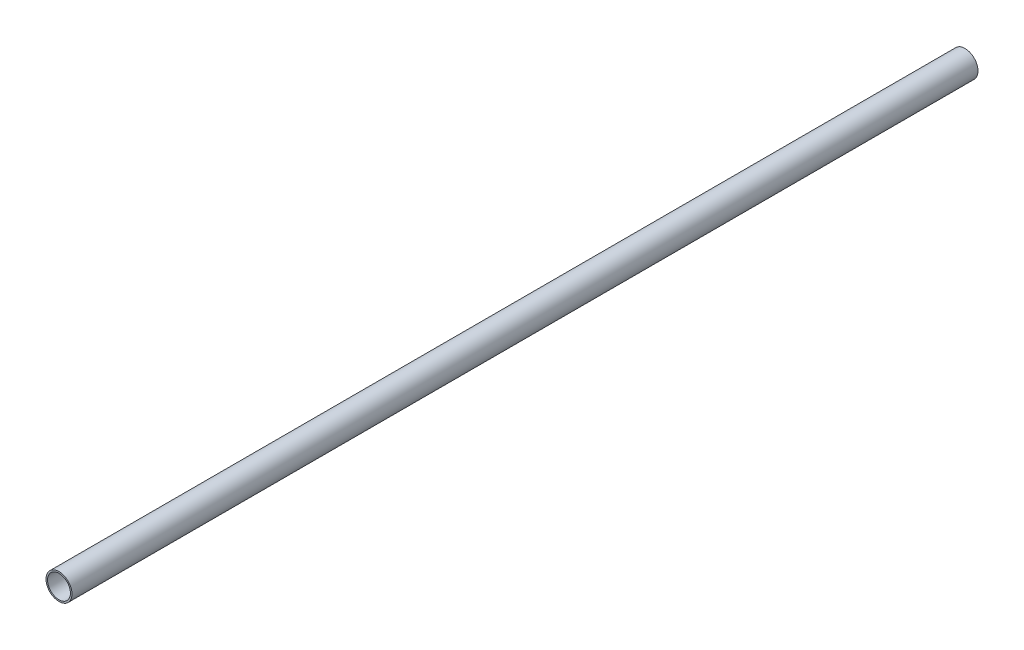
ISO-10303-21;
HEADER;
FILE_DESCRIPTION(('STEP AP214'),'2;1');
FILE_NAME('part.step','',(''),(''),'','','');
FILE_SCHEMA(('AUTOMOTIVE_DESIGN { 1 0 10303 214 1 1 1 1 }'));
ENDSEC;
DATA;
#1=APPLICATION_CONTEXT('core data for automotive mechanical design processes');
#2=APPLICATION_PROTOCOL_DEFINITION('international standard','automotive_design',2000,#1);
#3=PRODUCT_CONTEXT('',#1,'mechanical');
#4=PRODUCT('Part','Part','',(#3));
#5=PRODUCT_RELATED_PRODUCT_CATEGORY('part','',(#4));
#6=PRODUCT_DEFINITION_FORMATION('','',#4);
#7=PRODUCT_DEFINITION_CONTEXT('part definition',#1,'design');
#8=PRODUCT_DEFINITION('design','',#6,#7);
#9=PRODUCT_DEFINITION_SHAPE('','',#8);
#10=(LENGTH_UNIT() NAMED_UNIT(*) SI_UNIT(.MILLI.,.METRE.));
#11=(NAMED_UNIT(*) PLANE_ANGLE_UNIT() SI_UNIT($,.RADIAN.));
#12=(NAMED_UNIT(*) SI_UNIT($,.STERADIAN.) SOLID_ANGLE_UNIT());
#13=UNCERTAINTY_MEASURE_WITH_UNIT(LENGTH_MEASURE(1.E-05),#10,'distance_accuracy_value','');
#14=(GEOMETRIC_REPRESENTATION_CONTEXT(3) GLOBAL_UNCERTAINTY_ASSIGNED_CONTEXT((#13)) GLOBAL_UNIT_ASSIGNED_CONTEXT((#10,
#11,#12)) REPRESENTATION_CONTEXT('',''));
#15=CARTESIAN_POINT('',(0.,0.,0.));
#16=DIRECTION('',(0.,0.,1.));
#17=DIRECTION('',(1.,0.,0.));
#18=AXIS2_PLACEMENT_3D('',#15,#16,#17);
#19=CARTESIAN_POINT('',(0.,1269.,1.77635683940025E-12));
#20=DIRECTION('',(0.,0.,-0.999999999999983));
#21=DIRECTION('',(0.,1.,0.));
#22=AXIS2_PLACEMENT_3D('',#19,#20,#21);
#23=CYLINDRICAL_SURFACE('',#22,12.5);
#24=CARTESIAN_POINT('',(0.,1269.,-891.499999999976));
#25=DIRECTION('',(0.,0.,-0.999999999999983));
#26=DIRECTION('',(0.,1.,0.));
#27=AXIS2_PLACEMENT_3D('',#24,#25,#26);
#28=CIRCLE('',#27,12.5);
#29=CARTESIAN_POINT('',(2.37543317861737E-12,1281.5,-891.499999999976));
#30=VERTEX_POINT('',#29);
#31=EDGE_CURVE('E54',#30,#30,#28,.T.);
#32=CARTESIAN_POINT('',(0.,1269.,-19.9999999999982));
#33=DIRECTION('',(0.,0.,0.999999999999983));
#34=DIRECTION('',(1.,0.,0.));
#35=AXIS2_PLACEMENT_3D('',#32,#33,#34);
#36=CIRCLE('',#35,12.5);
#37=CARTESIAN_POINT('',(0.,1281.5,-19.9999999999982));
#38=VERTEX_POINT('',#37);
#39=EDGE_CURVE('E41',#38,#38,#36,.T.);
#40=CARTESIAN_POINT('',(2.37543317861737E-12,1281.5,-891.499999999976));
#41=CARTESIAN_POINT('',(2.35124419451795E-12,1281.5,-882.421874999976));
#42=CARTESIAN_POINT('',(2.32705521041853E-12,1281.5,-873.343749999977));
#43=CARTESIAN_POINT('',(2.27867724221968E-12,1281.5,-855.187499999977));
#44=CARTESIAN_POINT('',(2.25448825812026E-12,1281.5,-846.109374999977));
#45=CARTESIAN_POINT('',(2.20611028992141E-12,1281.5,-827.953124999978));
#46=CARTESIAN_POINT('',(2.18192130582199E-12,1281.5,-818.874999999978));
#47=CARTESIAN_POINT('',(2.13354333762314E-12,1281.5,-800.718749999979));
#48=CARTESIAN_POINT('',(2.10935435352372E-12,1281.5,-791.640624999979));
#49=CARTESIAN_POINT('',(2.06097638532487E-12,1281.5,-773.484374999979));
#50=CARTESIAN_POINT('',(2.03678740122545E-12,1281.5,-764.406249999979));
#51=CARTESIAN_POINT('',(1.9884094330266E-12,1281.5,-746.24999999998));
#52=CARTESIAN_POINT('',(1.96422044892718E-12,1281.5,-737.17187499998));
#53=CARTESIAN_POINT('',(1.91584248072833E-12,1281.5,-719.015624999981));
#54=CARTESIAN_POINT('',(1.89165349662891E-12,1281.5,-709.937499999981));
#55=CARTESIAN_POINT('',(1.84327552843006E-12,1281.5,-691.781249999981));
#56=CARTESIAN_POINT('',(1.81908654433064E-12,1281.5,-682.703124999982));
#57=CARTESIAN_POINT('',(1.77070857613179E-12,1281.5,-664.546874999982));
#58=CARTESIAN_POINT('',(1.74651959203237E-12,1281.5,-655.468749999982));
#59=CARTESIAN_POINT('',(1.69814162383352E-12,1281.5,-637.312499999983));
#60=CARTESIAN_POINT('',(1.6739526397341E-12,1281.5,-628.234374999983));
#61=CARTESIAN_POINT('',(1.62557467153525E-12,1281.5,-610.078124999983));
#62=CARTESIAN_POINT('',(1.60138568743583E-12,1281.5,-600.999999999984));
#63=CARTESIAN_POINT('',(1.55300771923698E-12,1281.5,-582.843749999984));
#64=CARTESIAN_POINT('',(1.52881873513756E-12,1281.5,-573.765624999984));
#65=CARTESIAN_POINT('',(1.48044076693871E-12,1281.5,-555.609374999985));
#66=CARTESIAN_POINT('',(1.45625178283929E-12,1281.5,-546.531249999985));
#67=CARTESIAN_POINT('',(1.40787381464044E-12,1281.5,-528.374999999985));
#68=CARTESIAN_POINT('',(1.38368483054102E-12,1281.5,-519.296874999986));
#69=CARTESIAN_POINT('',(1.33530686234217E-12,1281.5,-501.140624999986));
#70=CARTESIAN_POINT('',(1.31111787824275E-12,1281.5,-492.062499999986));
#71=CARTESIAN_POINT('',(1.2627399100439E-12,1281.5,-473.906249999987));
#72=CARTESIAN_POINT('',(1.23855092594448E-12,1281.5,-464.828124999987));
#73=CARTESIAN_POINT('',(1.19017295774563E-12,1281.5,-446.671874999987));
#74=CARTESIAN_POINT('',(1.16598397364621E-12,1281.5,-437.593749999988));
#75=CARTESIAN_POINT('',(1.11760600544736E-12,1281.5,-419.437499999988));
#76=CARTESIAN_POINT('',(1.09341702134794E-12,1281.5,-410.359374999988));
#77=CARTESIAN_POINT('',(1.04503905314909E-12,1281.5,-392.203124999989));
#78=CARTESIAN_POINT('',(1.02085006904967E-12,1281.5,-383.124999999989));
#79=CARTESIAN_POINT('',(9.72472100850824E-13,1281.5,-364.96874999999));
#80=CARTESIAN_POINT('',(9.48283116751401E-13,1281.5,-355.89062499999));
#81=CARTESIAN_POINT('',(8.99905148552554E-13,1281.5,-337.73437499999));
#82=CARTESIAN_POINT('',(8.75716164453131E-13,1281.5,-328.656249999991));
#83=CARTESIAN_POINT('',(8.27338196254284E-13,1281.5,-310.499999999991));
#84=CARTESIAN_POINT('',(8.03149212154861E-13,1281.5,-301.421874999991));
#85=CARTESIAN_POINT('',(7.54771243956015E-13,1281.5,-283.265624999992));
#86=CARTESIAN_POINT('',(7.30582259856591E-13,1281.5,-274.187499999992));
#87=CARTESIAN_POINT('',(6.82204291657745E-13,1281.5,-256.031249999992));
#88=CARTESIAN_POINT('',(6.58015307558322E-13,1281.5,-246.953124999992));
#89=CARTESIAN_POINT('',(6.09637339359475E-13,1281.5,-228.796874999993));
#90=CARTESIAN_POINT('',(5.85448355260052E-13,1281.5,-219.718749999993));
#91=CARTESIAN_POINT('',(5.37070387061206E-13,1281.5,-201.562499999994));
#92=CARTESIAN_POINT('',(5.12881402961782E-13,1281.5,-192.484374999994));
#93=CARTESIAN_POINT('',(4.64503434762936E-13,1281.5,-174.328124999994));
#94=CARTESIAN_POINT('',(4.40314450663513E-13,1281.5,-165.249999999995));
#95=CARTESIAN_POINT('',(3.91936482464666E-13,1281.5,-147.093749999995));
#96=CARTESIAN_POINT('',(3.67747498365243E-13,1281.5,-138.015624999995));
#97=CARTESIAN_POINT('',(3.19369530166397E-13,1281.5,-119.859374999996));
#98=CARTESIAN_POINT('',(2.95180546066973E-13,1281.5,-110.781249999996));
#99=CARTESIAN_POINT('',(2.46802577868127E-13,1281.5,-92.6249999999964));
#100=CARTESIAN_POINT('',(2.22613593768704E-13,1281.5,-83.5468749999966));
#101=CARTESIAN_POINT('',(1.74235625569857E-13,1281.5,-65.3906249999971));
#102=CARTESIAN_POINT('',(1.50046641470434E-13,1281.5,-56.3124999999973));
#103=CARTESIAN_POINT('',(1.01668673271588E-13,1281.5,-38.1562499999978));
#104=CARTESIAN_POINT('',(0.,1281.5,-29.078124999998));
#105=CARTESIAN_POINT('',(0.,1281.5,-19.9999999999982));
#106=B_SPLINE_CURVE_WITH_KNOTS('',3,(#40,#41,#42,#43,#44,#45,#46,#47,#48,#49,#50,#51,#52,#53,
#54,#55,#56,#57,#58,#59,#60,#61,#62,#63,#64,#65,#66,#67,#68,#69,#70,#71,#72,#73,#74,#75,#76,#77,
#78,#79,#80,#81,#82,#83,#84,#85,#86,#87,#88,#89,#90,#91,#92,#93,#94,#95,#96,#97,#98,#99,#100,
#101,#102,#103,#104,#105),.UNSPECIFIED.,.F.,.F.,(4,2,2,2,2,2,2,2,2,2,2,2,2,2,2,2,2,2,2,2,2,2,2,
2,2,2,2,2,2,2,2,2,4),(0.,27.2343749999994,54.4687499999986,81.703124999998,108.937499999997,
136.171874999997,163.406249999996,190.640624999995,217.874999999995,245.109374999994,
272.343749999993,299.578124999992,326.812499999992,354.046874999991,381.28124999999,
408.51562499999,435.749999999989,462.984374999988,490.218749999988,517.453124999987,
544.687499999986,571.921874999985,599.156249999985,626.390624999984,653.624999999984,
680.859374999983,708.093749999982,735.328124999981,762.562499999981,789.79687499998,
817.03124999998,844.265624999979,871.499999999978),.UNSPECIFIED.);
#107=EDGE_CURVE('BSEAM37',#30,#38,#106,.T.);
#108=ORIENTED_EDGE('',*,*,#31,.F.);
#109=ORIENTED_EDGE('',*,*,#39,.F.);
#110=ORIENTED_EDGE('',*,*,#107,.T.);
#111=ORIENTED_EDGE('',*,*,#107,.F.);
#112=EDGE_LOOP('',(#108,#110,#109,#111));
#113=FACE_BOUND('',#112,.T.);
#114=ADVANCED_FACE('F37',(#113),#23,.T.);
#115=CARTESIAN_POINT('',(-15.4999999999998,4.44089209850063E-13,-891.499999999982));
#116=DIRECTION('',(0.,0.,-0.999999999999983));
#117=DIRECTION('',(0.,1.,0.));
#118=AXIS2_PLACEMENT_3D('',#115,#116,#117);
#119=PLANE('',#118);
#120=CARTESIAN_POINT('',(0.,1269.,-891.499999999976));
#121=DIRECTION('',(0.,0.,-0.999999999999983));
#122=DIRECTION('',(0.,1.,0.));
#123=AXIS2_PLACEMENT_3D('',#120,#121,#122);
#124=CIRCLE('',#123,10.9999999999999);
#125=CARTESIAN_POINT('',(2.37543317861737E-12,1280.,-891.499999999976));
#126=VERTEX_POINT('',#125);
#127=EDGE_CURVE('E52',#126,#126,#124,.T.);
#128=ORIENTED_EDGE('',*,*,#127,.F.);
#129=EDGE_LOOP('',(#128));
#130=FACE_BOUND('',#129,.T.);
#131=ORIENTED_EDGE('',*,*,#31,.T.);
#132=EDGE_LOOP('',(#131));
#133=FACE_BOUND('',#132,.T.);
#134=ADVANCED_FACE('F66',(#130,#133),#119,.T.);
#135=CARTESIAN_POINT('',(-15.4999999999998,1960.,-20.0000000000005));
#136=DIRECTION('',(0.,0.,0.999999999999983));
#137=DIRECTION('',(1.,0.,0.));
#138=AXIS2_PLACEMENT_3D('',#135,#136,#137);
#139=PLANE('',#138);
#140=CARTESIAN_POINT('',(0.,1269.,-19.9999999999982));
#141=DIRECTION('',(0.,0.,0.999999999999983));
#142=DIRECTION('',(1.,0.,0.));
#143=AXIS2_PLACEMENT_3D('',#140,#141,#142);
#144=CIRCLE('',#143,10.9999999999999);
#145=CARTESIAN_POINT('',(0.,1280.,-19.9999999999982));
#146=VERTEX_POINT('',#145);
#147=EDGE_CURVE('E10',#146,#146,#144,.T.);
#148=ORIENTED_EDGE('',*,*,#147,.F.);
#149=EDGE_LOOP('',(#148));
#150=FACE_BOUND('',#149,.T.);
#151=ORIENTED_EDGE('',*,*,#39,.T.);
#152=EDGE_LOOP('',(#151));
#153=FACE_BOUND('',#152,.T.);
#154=ADVANCED_FACE('F68',(#150,#153),#139,.T.);
#155=CARTESIAN_POINT('',(0.,1269.,1.77635683940025E-12));
#156=DIRECTION('',(0.,0.,-0.999999999999983));
#157=DIRECTION('',(0.,1.,0.));
#158=AXIS2_PLACEMENT_3D('',#155,#156,#157);
#159=CYLINDRICAL_SURFACE('',#158,10.9999999999999);
#160=CARTESIAN_POINT('',(2.37543317861737E-12,1280.,-891.499999999976));
#161=CARTESIAN_POINT('',(2.35124419451795E-12,1280.,-882.421874999976));
#162=CARTESIAN_POINT('',(2.32705521041853E-12,1280.,-873.343749999977));
#163=CARTESIAN_POINT('',(2.27867724221968E-12,1280.,-855.187499999977));
#164=CARTESIAN_POINT('',(2.25448825812026E-12,1280.,-846.109374999977));
#165=CARTESIAN_POINT('',(2.20611028992141E-12,1280.,-827.953124999978));
#166=CARTESIAN_POINT('',(2.18192130582199E-12,1280.,-818.874999999978));
#167=CARTESIAN_POINT('',(2.13354333762314E-12,1280.,-800.718749999979));
#168=CARTESIAN_POINT('',(2.10935435352372E-12,1280.,-791.640624999979));
#169=CARTESIAN_POINT('',(2.06097638532487E-12,1280.,-773.484374999979));
#170=CARTESIAN_POINT('',(2.03678740122545E-12,1280.,-764.406249999979));
#171=CARTESIAN_POINT('',(1.9884094330266E-12,1280.,-746.24999999998));
#172=CARTESIAN_POINT('',(1.96422044892718E-12,1280.,-737.17187499998));
#173=CARTESIAN_POINT('',(1.91584248072833E-12,1280.,-719.015624999981));
#174=CARTESIAN_POINT('',(1.89165349662891E-12,1280.,-709.937499999981));
#175=CARTESIAN_POINT('',(1.84327552843006E-12,1280.,-691.781249999981));
#176=CARTESIAN_POINT('',(1.81908654433064E-12,1280.,-682.703124999982));
#177=CARTESIAN_POINT('',(1.77070857613179E-12,1280.,-664.546874999982));
#178=CARTESIAN_POINT('',(1.74651959203237E-12,1280.,-655.468749999982));
#179=CARTESIAN_POINT('',(1.69814162383352E-12,1280.,-637.312499999983));
#180=CARTESIAN_POINT('',(1.6739526397341E-12,1280.,-628.234374999983));
#181=CARTESIAN_POINT('',(1.62557467153525E-12,1280.,-610.078124999983));
#182=CARTESIAN_POINT('',(1.60138568743583E-12,1280.,-600.999999999984));
#183=CARTESIAN_POINT('',(1.55300771923698E-12,1280.,-582.843749999984));
#184=CARTESIAN_POINT('',(1.52881873513756E-12,1280.,-573.765624999984));
#185=CARTESIAN_POINT('',(1.48044076693871E-12,1280.,-555.609374999985));
#186=CARTESIAN_POINT('',(1.45625178283929E-12,1280.,-546.531249999985));
#187=CARTESIAN_POINT('',(1.40787381464044E-12,1280.,-528.374999999985));
#188=CARTESIAN_POINT('',(1.38368483054102E-12,1280.,-519.296874999986));
#189=CARTESIAN_POINT('',(1.33530686234217E-12,1280.,-501.140624999986));
#190=CARTESIAN_POINT('',(1.31111787824275E-12,1280.,-492.062499999986));
#191=CARTESIAN_POINT('',(1.2627399100439E-12,1280.,-473.906249999987));
#192=CARTESIAN_POINT('',(1.23855092594448E-12,1280.,-464.828124999987));
#193=CARTESIAN_POINT('',(1.19017295774563E-12,1280.,-446.671874999987));
#194=CARTESIAN_POINT('',(1.16598397364621E-12,1280.,-437.593749999988));
#195=CARTESIAN_POINT('',(1.11760600544736E-12,1280.,-419.437499999988));
#196=CARTESIAN_POINT('',(1.09341702134794E-12,1280.,-410.359374999988));
#197=CARTESIAN_POINT('',(1.04503905314909E-12,1280.,-392.203124999989));
#198=CARTESIAN_POINT('',(1.02085006904967E-12,1280.,-383.124999999989));
#199=CARTESIAN_POINT('',(9.72472100850824E-13,1280.,-364.96874999999));
#200=CARTESIAN_POINT('',(9.48283116751401E-13,1280.,-355.89062499999));
#201=CARTESIAN_POINT('',(8.99905148552554E-13,1280.,-337.73437499999));
#202=CARTESIAN_POINT('',(8.75716164453131E-13,1280.,-328.656249999991));
#203=CARTESIAN_POINT('',(8.27338196254284E-13,1280.,-310.499999999991));
#204=CARTESIAN_POINT('',(8.03149212154861E-13,1280.,-301.421874999991));
#205=CARTESIAN_POINT('',(7.54771243956015E-13,1280.,-283.265624999992));
#206=CARTESIAN_POINT('',(7.30582259856591E-13,1280.,-274.187499999992));
#207=CARTESIAN_POINT('',(6.82204291657745E-13,1280.,-256.031249999992));
#208=CARTESIAN_POINT('',(6.58015307558322E-13,1280.,-246.953124999992));
#209=CARTESIAN_POINT('',(6.09637339359475E-13,1280.,-228.796874999993));
#210=CARTESIAN_POINT('',(5.85448355260052E-13,1280.,-219.718749999993));
#211=CARTESIAN_POINT('',(5.37070387061206E-13,1280.,-201.562499999994));
#212=CARTESIAN_POINT('',(5.12881402961782E-13,1280.,-192.484374999994));
#213=CARTESIAN_POINT('',(4.64503434762936E-13,1280.,-174.328124999994));
#214=CARTESIAN_POINT('',(4.40314450663513E-13,1280.,-165.249999999995));
#215=CARTESIAN_POINT('',(3.91936482464666E-13,1280.,-147.093749999995));
#216=CARTESIAN_POINT('',(3.67747498365243E-13,1280.,-138.015624999995));
#217=CARTESIAN_POINT('',(3.19369530166397E-13,1280.,-119.859374999996));
#218=CARTESIAN_POINT('',(2.95180546066973E-13,1280.,-110.781249999996));
#219=CARTESIAN_POINT('',(2.46802577868127E-13,1280.,-92.6249999999964));
#220=CARTESIAN_POINT('',(2.22613593768704E-13,1280.,-83.5468749999966));
#221=CARTESIAN_POINT('',(1.74235625569857E-13,1280.,-65.3906249999971));
#222=CARTESIAN_POINT('',(1.50046641470434E-13,1280.,-56.3124999999973));
#223=CARTESIAN_POINT('',(1.01668673271588E-13,1280.,-38.1562499999978));
#224=CARTESIAN_POINT('',(0.,1280.,-29.078124999998));
#225=CARTESIAN_POINT('',(0.,1280.,-19.9999999999982));
#226=B_SPLINE_CURVE_WITH_KNOTS('',3,(#160,#161,#162,#163,#164,#165,#166,#167,#168,#169,#170,
#171,#172,#173,#174,#175,#176,#177,#178,#179,#180,#181,#182,#183,#184,#185,#186,#187,#188,#189,
#190,#191,#192,#193,#194,#195,#196,#197,#198,#199,#200,#201,#202,#203,#204,#205,#206,#207,#208,
#209,#210,#211,#212,#213,#214,#215,#216,#217,#218,#219,#220,#221,#222,#223,#224,#225),
.UNSPECIFIED.,.F.,.F.,(4,2,2,2,2,2,2,2,2,2,2,2,2,2,2,2,2,2,2,2,2,2,2,2,2,2,2,2,2,2,2,2,4),(0.,
27.2343749999994,54.4687499999986,81.703124999998,108.937499999997,136.171874999997,
163.406249999996,190.640624999995,217.874999999995,245.109374999994,272.343749999993,
299.578124999992,326.812499999992,354.046874999991,381.28124999999,408.51562499999,
435.749999999989,462.984374999988,490.218749999988,517.453124999987,544.687499999986,
571.921874999985,599.156249999985,626.390624999984,653.624999999984,680.859374999983,
708.093749999982,735.328124999981,762.562499999981,789.79687499998,817.03124999998,
844.265624999979,871.499999999978),.UNSPECIFIED.);
#227=EDGE_CURVE('BSEAM39',#126,#146,#226,.T.);
#228=ORIENTED_EDGE('',*,*,#127,.T.);
#229=ORIENTED_EDGE('',*,*,#147,.T.);
#230=ORIENTED_EDGE('',*,*,#227,.T.);
#231=ORIENTED_EDGE('',*,*,#227,.F.);
#232=EDGE_LOOP('',(#228,#230,#229,#231));
#233=FACE_BOUND('',#232,.T.);
#234=ADVANCED_FACE('F39',(#233),#159,.F.);
#235=CLOSED_SHELL('',(#114,#134,#154,#234));
#236=MANIFOLD_SOLID_BREP('B2',#235);
#237=ADVANCED_BREP_SHAPE_REPRESENTATION('',(#18,#236),#14);
#238=SHAPE_DEFINITION_REPRESENTATION(#9,#237);
ENDSEC;
END-ISO-10303-21;
